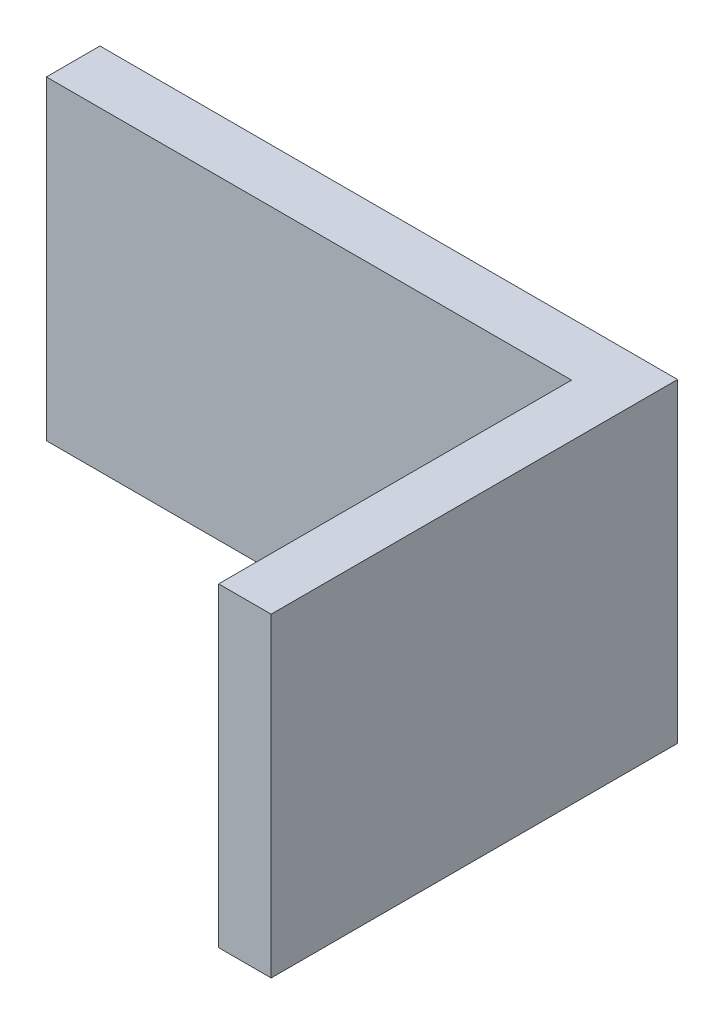
ISO-10303-21;
HEADER;
FILE_DESCRIPTION(('STEP AP214'),'2;1');
FILE_NAME('part.step','',(''),(''),'','','');
FILE_SCHEMA(('AUTOMOTIVE_DESIGN { 1 0 10303 214 1 1 1 1 }'));
ENDSEC;
DATA;
#1=APPLICATION_CONTEXT('core data for automotive mechanical design processes');
#2=APPLICATION_PROTOCOL_DEFINITION('international standard','automotive_design',2000,#1);
#3=PRODUCT_CONTEXT('',#1,'mechanical');
#4=PRODUCT('Part','Part','',(#3));
#5=PRODUCT_RELATED_PRODUCT_CATEGORY('part','',(#4));
#6=PRODUCT_DEFINITION_FORMATION('','',#4);
#7=PRODUCT_DEFINITION_CONTEXT('part definition',#1,'design');
#8=PRODUCT_DEFINITION('design','',#6,#7);
#9=PRODUCT_DEFINITION_SHAPE('','',#8);
#10=(LENGTH_UNIT() NAMED_UNIT(*) SI_UNIT(.MILLI.,.METRE.));
#11=(NAMED_UNIT(*) PLANE_ANGLE_UNIT() SI_UNIT($,.RADIAN.));
#12=(NAMED_UNIT(*) SI_UNIT($,.STERADIAN.) SOLID_ANGLE_UNIT());
#13=UNCERTAINTY_MEASURE_WITH_UNIT(LENGTH_MEASURE(1.E-05),#10,'distance_accuracy_value','');
#14=(GEOMETRIC_REPRESENTATION_CONTEXT(3) GLOBAL_UNCERTAINTY_ASSIGNED_CONTEXT((#13)) GLOBAL_UNIT_ASSIGNED_CONTEXT((#10,
#11,#12)) REPRESENTATION_CONTEXT('',''));
#15=CARTESIAN_POINT('',(0.,0.,0.));
#16=DIRECTION('',(0.,0.,1.));
#17=DIRECTION('',(1.,0.,0.));
#18=AXIS2_PLACEMENT_3D('',#15,#16,#17);
#19=CARTESIAN_POINT('',(4.55,-1.6,0.));
#20=DIRECTION('',(0.,1.,0.));
#21=DIRECTION('',(0.,0.,1.));
#22=AXIS2_PLACEMENT_3D('',#19,#20,#21);
#23=PLANE('',#22);
#24=DIRECTION('',(1.,0.,0.));
#25=VECTOR('',#24,1.);
#26=CARTESIAN_POINT('',(4.,-1.6,0.));
#27=LINE('',#26,#25);
#28=CARTESIAN_POINT('',(4.,-1.6,0.));
#29=VERTEX_POINT('',#28);
#30=CARTESIAN_POINT('',(4.55,-1.6,0.));
#31=VERTEX_POINT('',#30);
#32=EDGE_CURVE('E11',#29,#31,#27,.T.);
#33=ORIENTED_EDGE('',*,*,#32,.F.);
#34=DIRECTION('',(0.,0.,-1.));
#35=VECTOR('',#34,1.);
#36=CARTESIAN_POINT('',(4.,-1.6,0.051));
#37=LINE('',#36,#35);
#38=CARTESIAN_POINT('',(4.,-1.6,0.051));
#39=VERTEX_POINT('',#38);
#40=EDGE_CURVE('E24',#39,#29,#37,.T.);
#41=ORIENTED_EDGE('',*,*,#40,.F.);
#42=DIRECTION('',(-1.,0.,0.));
#43=VECTOR('',#42,1.);
#44=CARTESIAN_POINT('',(4.5,-1.6,0.051));
#45=LINE('',#44,#43);
#46=CARTESIAN_POINT('',(4.5,-1.6,0.051));
#47=VERTEX_POINT('',#46);
#48=EDGE_CURVE('E87',#47,#39,#45,.T.);
#49=ORIENTED_EDGE('',*,*,#48,.F.);
#50=DIRECTION('',(0.,0.,-1.));
#51=VECTOR('',#50,1.);
#52=CARTESIAN_POINT('',(4.5,-1.6,0.387));
#53=LINE('',#52,#51);
#54=CARTESIAN_POINT('',(4.5,-1.6,0.387));
#55=VERTEX_POINT('',#54);
#56=EDGE_CURVE('E114',#55,#47,#53,.T.);
#57=ORIENTED_EDGE('',*,*,#56,.F.);
#58=DIRECTION('',(-1.,0.,0.));
#59=VECTOR('',#58,1.);
#60=CARTESIAN_POINT('',(4.55,-1.6,0.387));
#61=LINE('',#60,#59);
#62=CARTESIAN_POINT('',(4.55,-1.6,0.387));
#63=VERTEX_POINT('',#62);
#64=EDGE_CURVE('E111',#63,#55,#61,.T.);
#65=ORIENTED_EDGE('',*,*,#64,.F.);
#66=DIRECTION('',(0.,0.,1.));
#67=VECTOR('',#66,1.);
#68=CARTESIAN_POINT('',(4.55,-1.6,0.));
#69=LINE('',#68,#67);
#70=EDGE_CURVE('E108',#31,#63,#69,.T.);
#71=ORIENTED_EDGE('',*,*,#70,.F.);
#72=EDGE_LOOP('',(#33,#41,#49,#57,#65,#71));
#73=FACE_BOUND('',#72,.T.);
#74=ADVANCED_FACE('F17',(#73),#23,.T.);
#75=CARTESIAN_POINT('',(4.,-1.9,0.));
#76=DIRECTION('',(0.,-1.,0.));
#77=DIRECTION('',(0.,0.,1.));
#78=AXIS2_PLACEMENT_3D('',#75,#76,#77);
#79=PLANE('',#78);
#80=DIRECTION('',(-1.,0.,0.));
#81=VECTOR('',#80,1.);
#82=CARTESIAN_POINT('',(4.55,-1.9,0.));
#83=LINE('',#82,#81);
#84=CARTESIAN_POINT('',(4.55,-1.9,0.));
#85=VERTEX_POINT('',#84);
#86=CARTESIAN_POINT('',(4.,-1.9,0.));
#87=VERTEX_POINT('',#86);
#88=EDGE_CURVE('E106',#85,#87,#83,.T.);
#89=ORIENTED_EDGE('',*,*,#88,.F.);
#90=DIRECTION('',(0.,0.,-1.));
#91=VECTOR('',#90,1.);
#92=CARTESIAN_POINT('',(4.55,-1.9,0.387));
#93=LINE('',#92,#91);
#94=CARTESIAN_POINT('',(4.55,-1.9,0.387));
#95=VERTEX_POINT('',#94);
#96=EDGE_CURVE('E103',#95,#85,#93,.T.);
#97=ORIENTED_EDGE('',*,*,#96,.F.);
#98=DIRECTION('',(1.,0.,0.));
#99=VECTOR('',#98,1.);
#100=CARTESIAN_POINT('',(4.5,-1.9,0.387));
#101=LINE('',#100,#99);
#102=CARTESIAN_POINT('',(4.5,-1.9,0.387));
#103=VERTEX_POINT('',#102);
#104=EDGE_CURVE('E100',#103,#95,#101,.T.);
#105=ORIENTED_EDGE('',*,*,#104,.F.);
#106=DIRECTION('',(0.,0.,1.));
#107=VECTOR('',#106,1.);
#108=CARTESIAN_POINT('',(4.5,-1.9,0.051));
#109=LINE('',#108,#107);
#110=CARTESIAN_POINT('',(4.5,-1.9,0.051));
#111=VERTEX_POINT('',#110);
#112=EDGE_CURVE('E72',#111,#103,#109,.T.);
#113=ORIENTED_EDGE('',*,*,#112,.F.);
#114=DIRECTION('',(1.,0.,0.));
#115=VECTOR('',#114,1.);
#116=CARTESIAN_POINT('',(4.,-1.9,0.051));
#117=LINE('',#116,#115);
#118=CARTESIAN_POINT('',(4.,-1.9,0.051));
#119=VERTEX_POINT('',#118);
#120=EDGE_CURVE('E66',#119,#111,#117,.T.);
#121=ORIENTED_EDGE('',*,*,#120,.F.);
#122=DIRECTION('',(0.,0.,1.));
#123=VECTOR('',#122,1.);
#124=CARTESIAN_POINT('',(4.,-1.9,0.));
#125=LINE('',#124,#123);
#126=EDGE_CURVE('E69',#87,#119,#125,.T.);
#127=ORIENTED_EDGE('',*,*,#126,.F.);
#128=EDGE_LOOP('',(#89,#97,#105,#113,#121,#127));
#129=FACE_BOUND('',#128,.T.);
#130=ADVANCED_FACE('F68',(#129),#79,.T.);
#131=CARTESIAN_POINT('',(4.55,-1.6,0.387));
#132=DIRECTION('',(0.,0.,1.));
#133=DIRECTION('',(0.,1.,0.));
#134=AXIS2_PLACEMENT_3D('',#131,#132,#133);
#135=PLANE('',#134);
#136=ORIENTED_EDGE('',*,*,#64,.T.);
#137=DIRECTION('',(0.,1.,0.));
#138=VECTOR('',#137,1.);
#139=CARTESIAN_POINT('',(4.5,-1.9,0.387));
#140=LINE('',#139,#138);
#141=EDGE_CURVE('E83',#103,#55,#140,.T.);
#142=ORIENTED_EDGE('',*,*,#141,.F.);
#143=ORIENTED_EDGE('',*,*,#104,.T.);
#144=DIRECTION('',(0.,-1.,0.));
#145=VECTOR('',#144,1.);
#146=CARTESIAN_POINT('',(4.55,-1.6,0.387));
#147=LINE('',#146,#145);
#148=EDGE_CURVE('E88',#63,#95,#147,.T.);
#149=ORIENTED_EDGE('',*,*,#148,.F.);
#150=EDGE_LOOP('',(#136,#142,#143,#149));
#151=FACE_BOUND('',#150,.T.);
#152=ADVANCED_FACE('F125',(#151),#135,.T.);
#153=CARTESIAN_POINT('',(4.5,-1.6,0.051));
#154=DIRECTION('',(0.,0.,1.));
#155=DIRECTION('',(0.,1.,0.));
#156=AXIS2_PLACEMENT_3D('',#153,#154,#155);
#157=PLANE('',#156);
#158=ORIENTED_EDGE('',*,*,#48,.T.);
#159=DIRECTION('',(0.,1.,0.));
#160=VECTOR('',#159,1.);
#161=CARTESIAN_POINT('',(4.,-1.9,0.051));
#162=LINE('',#161,#160);
#163=EDGE_CURVE('E81',#119,#39,#162,.T.);
#164=ORIENTED_EDGE('',*,*,#163,.F.);
#165=ORIENTED_EDGE('',*,*,#120,.T.);
#166=DIRECTION('',(0.,-1.,0.));
#167=VECTOR('',#166,1.);
#168=CARTESIAN_POINT('',(4.5,-1.6,0.051));
#169=LINE('',#168,#167);
#170=EDGE_CURVE('E89',#47,#111,#169,.T.);
#171=ORIENTED_EDGE('',*,*,#170,.F.);
#172=EDGE_LOOP('',(#158,#164,#165,#171));
#173=FACE_BOUND('',#172,.T.);
#174=ADVANCED_FACE('F86',(#173),#157,.T.);
#175=CARTESIAN_POINT('',(4.55,-1.9,0.));
#176=DIRECTION('',(1.,0.,0.));
#177=DIRECTION('',(0.,0.,1.));
#178=AXIS2_PLACEMENT_3D('',#175,#176,#177);
#179=PLANE('',#178);
#180=DIRECTION('',(0.,-1.,0.));
#181=VECTOR('',#180,1.);
#182=CARTESIAN_POINT('',(4.55,-1.6,0.));
#183=LINE('',#182,#181);
#184=EDGE_CURVE('E93',#31,#85,#183,.T.);
#185=ORIENTED_EDGE('',*,*,#184,.F.);
#186=ORIENTED_EDGE('',*,*,#70,.T.);
#187=ORIENTED_EDGE('',*,*,#148,.T.);
#188=ORIENTED_EDGE('',*,*,#96,.T.);
#189=EDGE_LOOP('',(#185,#186,#187,#188));
#190=FACE_BOUND('',#189,.T.);
#191=ADVANCED_FACE('F121',(#190),#179,.T.);
#192=CARTESIAN_POINT('',(4.,-1.6,0.));
#193=DIRECTION('',(-1.,0.,0.));
#194=DIRECTION('',(0.,0.,1.));
#195=AXIS2_PLACEMENT_3D('',#192,#193,#194);
#196=PLANE('',#195);
#197=DIRECTION('',(0.,1.,0.));
#198=VECTOR('',#197,1.);
#199=CARTESIAN_POINT('',(4.,-1.9,0.));
#200=LINE('',#199,#198);
#201=EDGE_CURVE('E82',#87,#29,#200,.T.);
#202=ORIENTED_EDGE('',*,*,#201,.F.);
#203=ORIENTED_EDGE('',*,*,#126,.T.);
#204=ORIENTED_EDGE('',*,*,#163,.T.);
#205=ORIENTED_EDGE('',*,*,#40,.T.);
#206=EDGE_LOOP('',(#202,#203,#204,#205));
#207=FACE_BOUND('',#206,.T.);
#208=ADVANCED_FACE('F80',(#207),#196,.T.);
#209=CARTESIAN_POINT('',(4.5,-1.6,0.051));
#210=DIRECTION('',(-1.,0.,0.));
#211=DIRECTION('',(0.,0.,1.));
#212=AXIS2_PLACEMENT_3D('',#209,#210,#211);
#213=PLANE('',#212);
#214=ORIENTED_EDGE('',*,*,#170,.T.);
#215=ORIENTED_EDGE('',*,*,#112,.T.);
#216=ORIENTED_EDGE('',*,*,#141,.T.);
#217=ORIENTED_EDGE('',*,*,#56,.T.);
#218=EDGE_LOOP('',(#214,#215,#216,#217));
#219=FACE_BOUND('',#218,.T.);
#220=ADVANCED_FACE('F127',(#219),#213,.T.);
#221=CARTESIAN_POINT('',(4.55,-1.9,0.));
#222=DIRECTION('',(0.,0.,-1.));
#223=DIRECTION('',(0.,1.,0.));
#224=AXIS2_PLACEMENT_3D('',#221,#222,#223);
#225=PLANE('',#224);
#226=ORIENTED_EDGE('',*,*,#88,.T.);
#227=ORIENTED_EDGE('',*,*,#201,.T.);
#228=ORIENTED_EDGE('',*,*,#32,.T.);
#229=ORIENTED_EDGE('',*,*,#184,.T.);
#230=EDGE_LOOP('',(#226,#227,#228,#229));
#231=FACE_BOUND('',#230,.T.);
#232=ADVANCED_FACE('F117',(#231),#225,.T.);
#233=CLOSED_SHELL('',(#74,#130,#152,#174,#191,#208,#220,#232));
#234=MANIFOLD_SOLID_BREP('B1',#233);
#235=ADVANCED_BREP_SHAPE_REPRESENTATION('',(#18,#234),#14);
#236=SHAPE_DEFINITION_REPRESENTATION(#9,#235);
ENDSEC;
END-ISO-10303-21;
